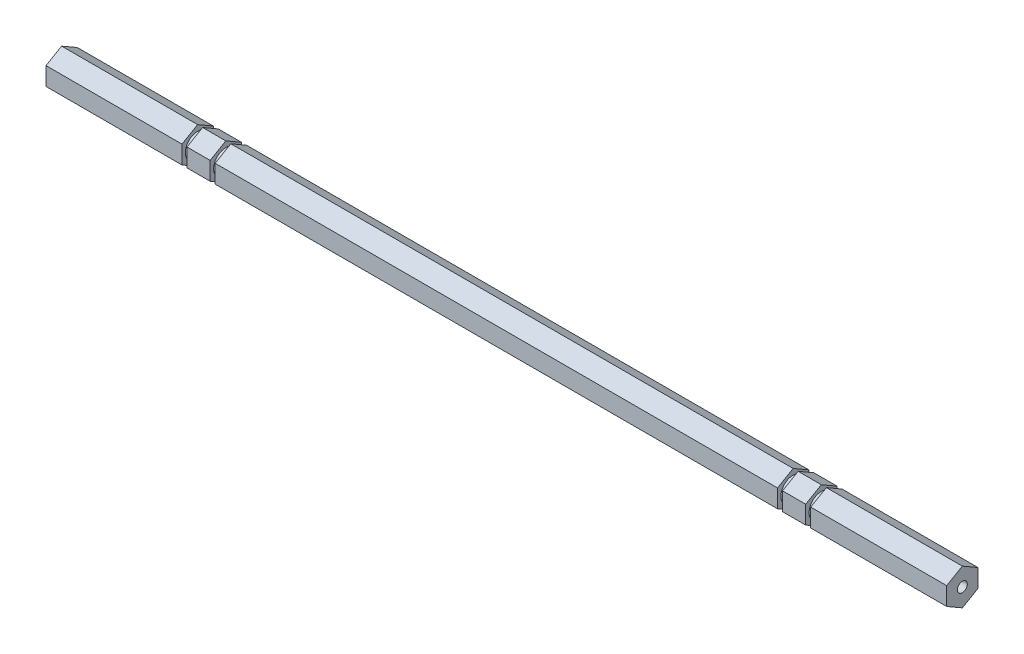
ISO-10303-21;
HEADER;
FILE_DESCRIPTION(('STEP AP214'),'2;1');
FILE_NAME('part.step','',(''),(''),'','','');
FILE_SCHEMA(('AUTOMOTIVE_DESIGN { 1 0 10303 214 1 1 1 1 }'));
ENDSEC;
DATA;
#1=APPLICATION_CONTEXT('core data for automotive mechanical design processes');
#2=APPLICATION_PROTOCOL_DEFINITION('international standard','automotive_design',2000,#1);
#3=PRODUCT_CONTEXT('',#1,'mechanical');
#4=PRODUCT('Part','Part','',(#3));
#5=PRODUCT_RELATED_PRODUCT_CATEGORY('part','',(#4));
#6=PRODUCT_DEFINITION_FORMATION('','',#4);
#7=PRODUCT_DEFINITION_CONTEXT('part definition',#1,'design');
#8=PRODUCT_DEFINITION('design','',#6,#7);
#9=PRODUCT_DEFINITION_SHAPE('','',#8);
#10=(LENGTH_UNIT() NAMED_UNIT(*) SI_UNIT(.MILLI.,.METRE.));
#11=(NAMED_UNIT(*) PLANE_ANGLE_UNIT() SI_UNIT($,.RADIAN.));
#12=(NAMED_UNIT(*) SI_UNIT($,.STERADIAN.) SOLID_ANGLE_UNIT());
#13=UNCERTAINTY_MEASURE_WITH_UNIT(LENGTH_MEASURE(1.E-05),#10,'distance_accuracy_value','');
#14=(GEOMETRIC_REPRESENTATION_CONTEXT(3) GLOBAL_UNCERTAINTY_ASSIGNED_CONTEXT((#13)) GLOBAL_UNIT_ASSIGNED_CONTEXT((#10,
#11,#12)) REPRESENTATION_CONTEXT('',''));
#15=CARTESIAN_POINT('',(0.,0.,0.));
#16=DIRECTION('',(0.,0.,1.));
#17=DIRECTION('',(1.,0.,0.));
#18=AXIS2_PLACEMENT_3D('',#15,#16,#17);
#19=CARTESIAN_POINT('',(384.52457044198,-3.66617420935407,-6.35000000000004));
#20=DIRECTION('',(0.,0.,1.));
#21=DIRECTION('',(0.,-1.,0.));
#22=AXIS2_PLACEMENT_3D('',#19,#20,#21);
#23=PLANE('',#22);
#24=DIRECTION('',(0.,1.,0.));
#25=VECTOR('',#24,1.);
#26=CARTESIAN_POINT('',(55.118,-3.66617420935407,-6.35000000000004));
#27=LINE('',#26,#25);
#28=CARTESIAN_POINT('',(55.118,-3.66617420935407,-6.35000000000004));
#29=VERTEX_POINT('',#28);
#30=CARTESIAN_POINT('',(55.118,3.6661742093542,-6.34999999999996));
#31=VERTEX_POINT('',#30);
#32=EDGE_CURVE('E79',#29,#31,#27,.T.);
#33=ORIENTED_EDGE('',*,*,#32,.F.);
#34=DIRECTION('',(-1.,0.,0.));
#35=VECTOR('',#34,1.);
#36=CARTESIAN_POINT('',(384.52457044198,-3.66617420935407,-6.35000000000004));
#37=LINE('',#36,#35);
#38=CARTESIAN_POINT('',(0.,-3.66617420935407,-6.35000000000004));
#39=VERTEX_POINT('',#38);
#40=EDGE_CURVE('E527',#29,#39,#37,.T.);
#41=ORIENTED_EDGE('',*,*,#40,.T.);
#42=DIRECTION('',(0.,1.,0.));
#43=VECTOR('',#42,1.);
#44=CARTESIAN_POINT('',(0.,-3.66617420935407,-6.35000000000004));
#45=LINE('',#44,#43);
#46=CARTESIAN_POINT('',(0.,3.6661742093542,-6.34999999999996));
#47=VERTEX_POINT('',#46);
#48=EDGE_CURVE('E518',#39,#47,#45,.T.);
#49=ORIENTED_EDGE('',*,*,#48,.T.);
#50=DIRECTION('',(-1.,0.,0.));
#51=VECTOR('',#50,1.);
#52=CARTESIAN_POINT('',(384.52457044198,3.6661742093542,-6.34999999999996));
#53=LINE('',#52,#51);
#54=EDGE_CURVE('E522',#31,#47,#53,.T.);
#55=ORIENTED_EDGE('',*,*,#54,.F.);
#56=EDGE_LOOP('',(#33,#41,#49,#55));
#57=FACE_BOUND('',#56,.T.);
#58=ADVANCED_FACE('F60',(#57),#23,.F.);
#59=CARTESIAN_POINT('',(384.52457044198,-7.33234841870825,0.));
#60=DIRECTION('',(0.,0.866025403784435,0.500000000000007));
#61=DIRECTION('',(0.,-0.500000000000007,0.866025403784435));
#62=AXIS2_PLACEMENT_3D('',#59,#60,#61);
#63=PLANE('',#62);
#64=DIRECTION('',(0.,0.500000000000007,-0.866025403784435));
#65=VECTOR('',#64,1.);
#66=CARTESIAN_POINT('',(55.118,-7.33234841870825,0.));
#67=LINE('',#66,#65);
#68=CARTESIAN_POINT('',(55.118,-7.33234841870825,0.));
#69=VERTEX_POINT('',#68);
#70=EDGE_CURVE('E449',#69,#29,#67,.T.);
#71=ORIENTED_EDGE('',*,*,#70,.F.);
#72=DIRECTION('',(-1.,0.,0.));
#73=VECTOR('',#72,1.);
#74=CARTESIAN_POINT('',(384.52457044198,-7.33234841870825,0.));
#75=LINE('',#74,#73);
#76=CARTESIAN_POINT('',(0.,-7.33234841870825,0.));
#77=VERTEX_POINT('',#76);
#78=EDGE_CURVE('E531',#69,#77,#75,.T.);
#79=ORIENTED_EDGE('',*,*,#78,.T.);
#80=DIRECTION('',(0.,0.500000000000007,-0.866025403784434));
#81=VECTOR('',#80,1.);
#82=CARTESIAN_POINT('',(0.,-7.33234841870825,0.));
#83=LINE('',#82,#81);
#84=EDGE_CURVE('E514',#77,#39,#83,.T.);
#85=ORIENTED_EDGE('',*,*,#84,.T.);
#86=ORIENTED_EDGE('',*,*,#40,.F.);
#87=EDGE_LOOP('',(#71,#79,#85,#86));
#88=FACE_BOUND('',#87,.T.);
#89=ADVANCED_FACE('F816',(#88),#63,.F.);
#90=CARTESIAN_POINT('',(384.52457044198,-3.66617420935416,6.34999999999999));
#91=DIRECTION('',(0.,0.866025403784441,-0.499999999999995));
#92=DIRECTION('',(0.,0.499999999999995,0.866025403784442));
#93=AXIS2_PLACEMENT_3D('',#90,#91,#92);
#94=PLANE('',#93);
#95=DIRECTION('',(0.,-0.499999999999995,-0.866025403784442));
#96=VECTOR('',#95,1.);
#97=CARTESIAN_POINT('',(55.118,-3.66617420935416,6.34999999999999));
#98=LINE('',#97,#96);
#99=CARTESIAN_POINT('',(55.118,-3.66617420935416,6.34999999999999));
#100=VERTEX_POINT('',#99);
#101=EDGE_CURVE('E446',#100,#69,#98,.T.);
#102=ORIENTED_EDGE('',*,*,#101,.F.);
#103=DIRECTION('',(-1.,0.,0.));
#104=VECTOR('',#103,1.);
#105=CARTESIAN_POINT('',(384.52457044198,-3.66617420935416,6.34999999999999));
#106=LINE('',#105,#104);
#107=CARTESIAN_POINT('',(0.,-3.66617420935416,6.34999999999999));
#108=VERTEX_POINT('',#107);
#109=EDGE_CURVE('E535',#100,#108,#106,.T.);
#110=ORIENTED_EDGE('',*,*,#109,.T.);
#111=DIRECTION('',(0.,-0.499999999999995,-0.866025403784442));
#112=VECTOR('',#111,1.);
#113=CARTESIAN_POINT('',(0.,-3.66617420935416,6.34999999999999));
#114=LINE('',#113,#112);
#115=EDGE_CURVE('E510',#108,#77,#114,.T.);
#116=ORIENTED_EDGE('',*,*,#115,.T.);
#117=ORIENTED_EDGE('',*,*,#78,.F.);
#118=EDGE_LOOP('',(#102,#110,#116,#117));
#119=FACE_BOUND('',#118,.T.);
#120=ADVANCED_FACE('F821',(#119),#94,.F.);
#121=CARTESIAN_POINT('',(384.52457044198,3.66617420935411,6.35000000000001));
#122=DIRECTION('',(0.,0.,-1.));
#123=DIRECTION('',(0.,1.,0.));
#124=AXIS2_PLACEMENT_3D('',#121,#122,#123);
#125=PLANE('',#124);
#126=DIRECTION('',(0.,-1.,0.));
#127=VECTOR('',#126,1.);
#128=CARTESIAN_POINT('',(55.118,3.66617420935411,6.35000000000001));
#129=LINE('',#128,#127);
#130=CARTESIAN_POINT('',(55.118,3.66617420935411,6.35000000000002));
#131=VERTEX_POINT('',#130);
#132=EDGE_CURVE('E357',#131,#100,#129,.T.);
#133=ORIENTED_EDGE('',*,*,#132,.F.);
#134=DIRECTION('',(-1.,0.,0.));
#135=VECTOR('',#134,1.);
#136=CARTESIAN_POINT('',(384.52457044198,3.66617420935411,6.35000000000001));
#137=LINE('',#136,#135);
#138=CARTESIAN_POINT('',(0.,3.66617420935411,6.35000000000001));
#139=VERTEX_POINT('',#138);
#140=EDGE_CURVE('E306',#131,#139,#137,.T.);
#141=ORIENTED_EDGE('',*,*,#140,.T.);
#142=DIRECTION('',(0.,-1.,0.));
#143=VECTOR('',#142,1.);
#144=CARTESIAN_POINT('',(0.,3.66617420935411,6.35000000000001));
#145=LINE('',#144,#143);
#146=EDGE_CURVE('E506',#139,#108,#145,.T.);
#147=ORIENTED_EDGE('',*,*,#146,.T.);
#148=ORIENTED_EDGE('',*,*,#109,.F.);
#149=EDGE_LOOP('',(#133,#141,#147,#148));
#150=FACE_BOUND('',#149,.T.);
#151=ADVANCED_FACE('F622',(#150),#125,.F.);
#152=CARTESIAN_POINT('',(384.52457044198,7.33234841870825,0.));
#153=DIRECTION('',(0.,-0.866025403784438,-0.500000000000001));
#154=DIRECTION('',(0.,0.500000000000001,-0.866025403784438));
#155=AXIS2_PLACEMENT_3D('',#152,#153,#154);
#156=PLANE('',#155);
#157=DIRECTION('',(0.,-0.500000000000001,0.866025403784438));
#158=VECTOR('',#157,1.);
#159=CARTESIAN_POINT('',(55.118,7.33234841870825,0.));
#160=LINE('',#159,#158);
#161=CARTESIAN_POINT('',(55.118,7.33234841870825,0.));
#162=VERTEX_POINT('',#161);
#163=EDGE_CURVE('E346',#162,#131,#160,.T.);
#164=ORIENTED_EDGE('',*,*,#163,.F.);
#165=DIRECTION('',(-1.,0.,0.));
#166=VECTOR('',#165,1.);
#167=CARTESIAN_POINT('',(384.52457044198,7.33234841870825,0.));
#168=LINE('',#167,#166);
#169=CARTESIAN_POINT('',(0.,7.33234841870825,0.));
#170=VERTEX_POINT('',#169);
#171=EDGE_CURVE('E305',#162,#170,#168,.T.);
#172=ORIENTED_EDGE('',*,*,#171,.T.);
#173=DIRECTION('',(0.,-0.500000000000001,0.866025403784438));
#174=VECTOR('',#173,1.);
#175=CARTESIAN_POINT('',(0.,7.33234841870825,0.));
#176=LINE('',#175,#174);
#177=EDGE_CURVE('E503',#170,#139,#176,.T.);
#178=ORIENTED_EDGE('',*,*,#177,.T.);
#179=ORIENTED_EDGE('',*,*,#140,.F.);
#180=EDGE_LOOP('',(#164,#172,#178,#179));
#181=FACE_BOUND('',#180,.T.);
#182=ADVANCED_FACE('F353',(#181),#156,.F.);
#183=CARTESIAN_POINT('',(384.52457044198,3.6661742093542,-6.34999999999996));
#184=DIRECTION('',(0.,-0.866025403784441,0.499999999999995));
#185=DIRECTION('',(0.,-0.499999999999995,-0.866025403784441));
#186=AXIS2_PLACEMENT_3D('',#183,#184,#185);
#187=PLANE('',#186);
#188=DIRECTION('',(0.,0.499999999999995,0.866025403784441));
#189=VECTOR('',#188,1.);
#190=CARTESIAN_POINT('',(55.118,3.6661742093542,-6.34999999999996));
#191=LINE('',#190,#189);
#192=EDGE_CURVE('E69',#31,#162,#191,.T.);
#193=ORIENTED_EDGE('',*,*,#192,.F.);
#194=ORIENTED_EDGE('',*,*,#54,.T.);
#195=DIRECTION('',(0.,0.499999999999995,0.866025403784441));
#196=VECTOR('',#195,1.);
#197=CARTESIAN_POINT('',(0.,3.6661742093542,-6.34999999999996));
#198=LINE('',#197,#196);
#199=EDGE_CURVE('E363',#47,#170,#198,.T.);
#200=ORIENTED_EDGE('',*,*,#199,.T.);
#201=ORIENTED_EDGE('',*,*,#171,.F.);
#202=EDGE_LOOP('',(#193,#194,#200,#201));
#203=FACE_BOUND('',#202,.T.);
#204=ADVANCED_FACE('F361',(#203),#187,.F.);
#205=CARTESIAN_POINT('',(0.,0.,0.));
#206=DIRECTION('',(1.,0.,0.));
#207=DIRECTION('',(0.,0.,-1.));
#208=AXIS2_PLACEMENT_3D('',#205,#206,#207);
#209=PLANE('',#208);
#210=CARTESIAN_POINT('',(0.,0.,0.));
#211=DIRECTION('',(-1.,0.,0.));
#212=DIRECTION('',(0.,0.,1.));
#213=AXIS2_PLACEMENT_3D('',#210,#211,#212);
#214=CIRCLE('',#213,2.01929999999999);
#215=CARTESIAN_POINT('',(0.,0.,2.01929999999999));
#216=VERTEX_POINT('',#215);
#217=EDGE_CURVE('E468',#216,#216,#214,.T.);
#218=ORIENTED_EDGE('',*,*,#217,.F.);
#219=EDGE_LOOP('',(#218));
#220=FACE_BOUND('',#219,.T.);
#221=ORIENTED_EDGE('',*,*,#199,.F.);
#222=ORIENTED_EDGE('',*,*,#48,.F.);
#223=ORIENTED_EDGE('',*,*,#84,.F.);
#224=ORIENTED_EDGE('',*,*,#115,.F.);
#225=ORIENTED_EDGE('',*,*,#146,.F.);
#226=ORIENTED_EDGE('',*,*,#177,.F.);
#227=EDGE_LOOP('',(#221,#222,#223,#224,#225,#226));
#228=FACE_BOUND('',#227,.T.);
#229=ADVANCED_FACE('F617',(#220,#228),#209,.F.);
#230=CARTESIAN_POINT('',(12.0396,0.,0.));
#231=DIRECTION('',(-1.,0.,0.));
#232=DIRECTION('',(0.,0.,1.));
#233=AXIS2_PLACEMENT_3D('',#230,#231,#232);
#234=CONICAL_SURFACE('',#233,2.01929999999999,1.02974425867665);
#235=CARTESIAN_POINT('',(13.2529178480023,0.,0.));
#236=VERTEX_POINT('',#235);
#237=VERTEX_LOOP('',#236);
#238=FACE_BOUND('',#237,.T.);
#239=CARTESIAN_POINT('',(12.0396,0.,0.));
#240=DIRECTION('',(-1.,0.,0.));
#241=DIRECTION('',(0.,0.,1.));
#242=AXIS2_PLACEMENT_3D('',#239,#240,#241);
#243=CIRCLE('',#242,2.01929999999999);
#244=CARTESIAN_POINT('',(12.0396,0.,2.01929999999999));
#245=VERTEX_POINT('',#244);
#246=EDGE_CURVE('E472',#245,#245,#243,.T.);
#247=ORIENTED_EDGE('',*,*,#246,.T.);
#248=EDGE_LOOP('',(#247));
#249=FACE_BOUND('',#248,.T.);
#250=ADVANCED_FACE('F901',(#238,#249),#234,.F.);
#251=CARTESIAN_POINT('',(0.,0.,0.));
#252=DIRECTION('',(-1.,0.,0.));
#253=DIRECTION('',(0.,0.,1.));
#254=AXIS2_PLACEMENT_3D('',#251,#252,#253);
#255=CYLINDRICAL_SURFACE('',#254,2.01929999999999);
#256=ORIENTED_EDGE('',*,*,#246,.F.);
#257=EDGE_LOOP('',(#256));
#258=FACE_BOUND('',#257,.T.);
#259=ORIENTED_EDGE('',*,*,#217,.T.);
#260=EDGE_LOOP('',(#259));
#261=FACE_BOUND('',#260,.T.);
#262=ADVANCED_FACE('F938',(#258,#261),#255,.F.);
#263=CARTESIAN_POINT('',(57.15,7.33234841870825,0.));
#264=DIRECTION('',(-1.,0.,0.));
#265=DIRECTION('',(0.,0.,1.));
#266=AXIS2_PLACEMENT_3D('',#263,#264,#265);
#267=PLANE('',#266);
#268=CARTESIAN_POINT('',(57.15,0.,0.));
#269=DIRECTION('',(-1.,0.,0.));
#270=DIRECTION('',(0.,0.,1.));
#271=AXIS2_PLACEMENT_3D('',#268,#269,#270);
#272=CIRCLE('',#271,4.9784);
#273=CARTESIAN_POINT('',(57.15,0.,4.9784));
#274=VERTEX_POINT('',#273);
#275=EDGE_CURVE('E281',#274,#274,#272,.T.);
#276=ORIENTED_EDGE('',*,*,#275,.F.);
#277=EDGE_LOOP('',(#276));
#278=FACE_BOUND('',#277,.T.);
#279=DIRECTION('',(0.,-1.,0.));
#280=VECTOR('',#279,1.);
#281=CARTESIAN_POINT('',(57.15,-3.66617420935407,-6.35000000000004));
#282=LINE('',#281,#280);
#283=CARTESIAN_POINT('',(57.15,3.6661742093542,-6.34999999999996));
#284=VERTEX_POINT('',#283);
#285=CARTESIAN_POINT('',(57.15,-3.66617420935407,-6.35000000000004));
#286=VERTEX_POINT('',#285);
#287=EDGE_CURVE('E465',#284,#286,#282,.T.);
#288=ORIENTED_EDGE('',*,*,#287,.T.);
#289=DIRECTION('',(0.,-0.500000000000007,0.866025403784435));
#290=VECTOR('',#289,1.);
#291=CARTESIAN_POINT('',(57.15,-7.33234841870825,0.));
#292=LINE('',#291,#290);
#293=CARTESIAN_POINT('',(57.15,-7.33234841870825,0.));
#294=VERTEX_POINT('',#293);
#295=EDGE_CURVE('E462',#286,#294,#292,.T.);
#296=ORIENTED_EDGE('',*,*,#295,.T.);
#297=DIRECTION('',(0.,0.499999999999995,0.866025403784442));
#298=VECTOR('',#297,1.);
#299=CARTESIAN_POINT('',(57.15,-3.66617420935416,6.34999999999999));
#300=LINE('',#299,#298);
#301=CARTESIAN_POINT('',(57.15,-3.66617420935416,6.34999999999999));
#302=VERTEX_POINT('',#301);
#303=EDGE_CURVE('E459',#294,#302,#300,.T.);
#304=ORIENTED_EDGE('',*,*,#303,.T.);
#305=DIRECTION('',(0.,1.,0.));
#306=VECTOR('',#305,1.);
#307=CARTESIAN_POINT('',(57.15,3.66617420935411,6.35000000000001));
#308=LINE('',#307,#306);
#309=CARTESIAN_POINT('',(57.15,3.66617420935411,6.35000000000002));
#310=VERTEX_POINT('',#309);
#311=EDGE_CURVE('E456',#302,#310,#308,.T.);
#312=ORIENTED_EDGE('',*,*,#311,.T.);
#313=DIRECTION('',(0.,0.500000000000001,-0.866025403784438));
#314=VECTOR('',#313,1.);
#315=CARTESIAN_POINT('',(57.15,7.33234841870825,0.));
#316=LINE('',#315,#314);
#317=CARTESIAN_POINT('',(57.15,7.33234841870825,0.));
#318=VERTEX_POINT('',#317);
#319=EDGE_CURVE('E454',#310,#318,#316,.T.);
#320=ORIENTED_EDGE('',*,*,#319,.T.);
#321=DIRECTION('',(0.,-0.499999999999995,-0.866025403784441));
#322=VECTOR('',#321,1.);
#323=CARTESIAN_POINT('',(57.15,3.6661742093542,-6.34999999999996));
#324=LINE('',#323,#322);
#325=EDGE_CURVE('E11',#318,#284,#324,.T.);
#326=ORIENTED_EDGE('',*,*,#325,.T.);
#327=EDGE_LOOP('',(#288,#296,#304,#312,#320,#326));
#328=FACE_BOUND('',#327,.T.);
#329=ADVANCED_FACE('F652',(#278,#328),#267,.T.);
#330=CARTESIAN_POINT('',(55.118,7.33234841870825,0.));
#331=DIRECTION('',(1.,0.,0.));
#332=DIRECTION('',(0.,0.,-1.));
#333=AXIS2_PLACEMENT_3D('',#330,#331,#332);
#334=PLANE('',#333);
#335=CARTESIAN_POINT('',(55.118,0.,0.));
#336=DIRECTION('',(-1.,0.,0.));
#337=DIRECTION('',(0.,0.,1.));
#338=AXIS2_PLACEMENT_3D('',#335,#336,#337);
#339=CIRCLE('',#338,4.9784);
#340=CARTESIAN_POINT('',(55.118,0.,4.9784));
#341=VERTEX_POINT('',#340);
#342=EDGE_CURVE('E716',#341,#341,#339,.T.);
#343=ORIENTED_EDGE('',*,*,#342,.T.);
#344=EDGE_LOOP('',(#343));
#345=FACE_BOUND('',#344,.T.);
#346=ORIENTED_EDGE('',*,*,#32,.T.);
#347=ORIENTED_EDGE('',*,*,#192,.T.);
#348=ORIENTED_EDGE('',*,*,#163,.T.);
#349=ORIENTED_EDGE('',*,*,#132,.T.);
#350=ORIENTED_EDGE('',*,*,#101,.T.);
#351=ORIENTED_EDGE('',*,*,#70,.T.);
#352=EDGE_LOOP('',(#346,#347,#348,#349,#350,#351));
#353=FACE_BOUND('',#352,.T.);
#354=ADVANCED_FACE('F345',(#345,#353),#334,.T.);
#355=CARTESIAN_POINT('',(0.,0.,0.));
#356=DIRECTION('',(-1.,0.,0.));
#357=DIRECTION('',(0.,0.,1.));
#358=AXIS2_PLACEMENT_3D('',#355,#356,#357);
#359=CYLINDRICAL_SURFACE('',#358,4.9784);
#360=ORIENTED_EDGE('',*,*,#275,.T.);
#361=EDGE_LOOP('',(#360));
#362=FACE_BOUND('',#361,.T.);
#363=ORIENTED_EDGE('',*,*,#342,.F.);
#364=EDGE_LOOP('',(#363));
#365=FACE_BOUND('',#364,.T.);
#366=ADVANCED_FACE('F894',(#362,#365),#359,.T.);
#367=ORIENTED_EDGE('',*,*,#325,.F.);
#368=CARTESIAN_POINT('',(66.548,7.33234841870825,0.));
#369=VERTEX_POINT('',#368);
#370=EDGE_CURVE('E365',#369,#318,#168,.T.);
#371=ORIENTED_EDGE('',*,*,#370,.F.);
#372=DIRECTION('',(0.,0.499999999999995,0.866025403784441));
#373=VECTOR('',#372,1.);
#374=CARTESIAN_POINT('',(66.5480000000001,3.6661742093542,-6.34999999999996));
#375=LINE('',#374,#373);
#376=CARTESIAN_POINT('',(66.5480000000001,3.6661742093542,-6.34999999999996));
#377=VERTEX_POINT('',#376);
#378=EDGE_CURVE('E336',#377,#369,#375,.T.);
#379=ORIENTED_EDGE('',*,*,#378,.F.);
#380=EDGE_CURVE('E601',#377,#284,#53,.T.);
#381=ORIENTED_EDGE('',*,*,#380,.T.);
#382=EDGE_LOOP('',(#367,#371,#379,#381));
#383=FACE_BOUND('',#382,.T.);
#384=ADVANCED_FACE('F62',(#383),#187,.F.);
#385=ORIENTED_EDGE('',*,*,#319,.F.);
#386=CARTESIAN_POINT('',(66.548,3.66617420935411,6.35000000000002));
#387=VERTEX_POINT('',#386);
#388=EDGE_CURVE('E309',#387,#310,#137,.T.);
#389=ORIENTED_EDGE('',*,*,#388,.F.);
#390=DIRECTION('',(0.,-0.500000000000001,0.866025403784438));
#391=VECTOR('',#390,1.);
#392=CARTESIAN_POINT('',(66.5480000000001,7.33234841870825,0.));
#393=LINE('',#392,#391);
#394=EDGE_CURVE('E408',#369,#387,#393,.T.);
#395=ORIENTED_EDGE('',*,*,#394,.F.);
#396=ORIENTED_EDGE('',*,*,#370,.T.);
#397=EDGE_LOOP('',(#385,#389,#395,#396));
#398=FACE_BOUND('',#397,.T.);
#399=ADVANCED_FACE('F653',(#398),#156,.F.);
#400=ORIENTED_EDGE('',*,*,#311,.F.);
#401=CARTESIAN_POINT('',(66.548,-3.66617420935416,6.34999999999999));
#402=VERTEX_POINT('',#401);
#403=EDGE_CURVE('E544',#402,#302,#106,.T.);
#404=ORIENTED_EDGE('',*,*,#403,.F.);
#405=DIRECTION('',(0.,-1.,0.));
#406=VECTOR('',#405,1.);
#407=CARTESIAN_POINT('',(66.5480000000001,3.66617420935411,6.35000000000001));
#408=LINE('',#407,#406);
#409=EDGE_CURVE('E414',#387,#402,#408,.T.);
#410=ORIENTED_EDGE('',*,*,#409,.F.);
#411=ORIENTED_EDGE('',*,*,#388,.T.);
#412=EDGE_LOOP('',(#400,#404,#410,#411));
#413=FACE_BOUND('',#412,.T.);
#414=ADVANCED_FACE('F649',(#413),#125,.F.);
#415=ORIENTED_EDGE('',*,*,#303,.F.);
#416=CARTESIAN_POINT('',(66.548,-7.33234841870825,0.));
#417=VERTEX_POINT('',#416);
#418=EDGE_CURVE('E548',#417,#294,#75,.T.);
#419=ORIENTED_EDGE('',*,*,#418,.F.);
#420=DIRECTION('',(0.,-0.499999999999995,-0.866025403784442));
#421=VECTOR('',#420,1.);
#422=CARTESIAN_POINT('',(66.5480000000001,-3.66617420935416,6.34999999999999));
#423=LINE('',#422,#421);
#424=EDGE_CURVE('E422',#402,#417,#423,.T.);
#425=ORIENTED_EDGE('',*,*,#424,.F.);
#426=ORIENTED_EDGE('',*,*,#403,.T.);
#427=EDGE_LOOP('',(#415,#419,#425,#426));
#428=FACE_BOUND('',#427,.T.);
#429=ADVANCED_FACE('F645',(#428),#94,.F.);
#430=ORIENTED_EDGE('',*,*,#295,.F.);
#431=CARTESIAN_POINT('',(66.548,-3.66617420935407,-6.35000000000004));
#432=VERTEX_POINT('',#431);
#433=EDGE_CURVE('E659',#432,#286,#37,.T.);
#434=ORIENTED_EDGE('',*,*,#433,.F.);
#435=DIRECTION('',(0.,0.500000000000007,-0.866025403784435));
#436=VECTOR('',#435,1.);
#437=CARTESIAN_POINT('',(66.5480000000001,-7.33234841870825,0.));
#438=LINE('',#437,#436);
#439=EDGE_CURVE('E425',#417,#432,#438,.T.);
#440=ORIENTED_EDGE('',*,*,#439,.F.);
#441=ORIENTED_EDGE('',*,*,#418,.T.);
#442=EDGE_LOOP('',(#430,#434,#440,#441));
#443=FACE_BOUND('',#442,.T.);
#444=ADVANCED_FACE('F813',(#443),#63,.F.);
#445=ORIENTED_EDGE('',*,*,#287,.F.);
#446=ORIENTED_EDGE('',*,*,#380,.F.);
#447=DIRECTION('',(0.,1.,0.));
#448=VECTOR('',#447,1.);
#449=CARTESIAN_POINT('',(66.5480000000001,-3.66617420935407,-6.35000000000004));
#450=LINE('',#449,#448);
#451=EDGE_CURVE('E87',#432,#377,#450,.T.);
#452=ORIENTED_EDGE('',*,*,#451,.F.);
#453=ORIENTED_EDGE('',*,*,#433,.T.);
#454=EDGE_LOOP('',(#445,#446,#452,#453));
#455=FACE_BOUND('',#454,.T.);
#456=ADVANCED_FACE('F657',(#455),#23,.F.);
#457=CARTESIAN_POINT('',(68.58,7.33234841870825,0.));
#458=DIRECTION('',(-1.,0.,0.));
#459=DIRECTION('',(0.,0.,1.));
#460=AXIS2_PLACEMENT_3D('',#457,#458,#459);
#461=PLANE('',#460);
#462=CARTESIAN_POINT('',(68.58,0.,0.));
#463=DIRECTION('',(-1.,0.,0.));
#464=DIRECTION('',(0.,0.,1.));
#465=AXIS2_PLACEMENT_3D('',#462,#463,#464);
#466=CIRCLE('',#465,4.9784);
#467=CARTESIAN_POINT('',(68.58,0.,4.9784));
#468=VERTEX_POINT('',#467);
#469=EDGE_CURVE('E713',#468,#468,#466,.T.);
#470=ORIENTED_EDGE('',*,*,#469,.F.);
#471=EDGE_LOOP('',(#470));
#472=FACE_BOUND('',#471,.T.);
#473=DIRECTION('',(0.,-1.,0.));
#474=VECTOR('',#473,1.);
#475=CARTESIAN_POINT('',(68.58,-3.66617420935407,-6.35000000000004));
#476=LINE('',#475,#474);
#477=CARTESIAN_POINT('',(68.58,3.6661742093542,-6.34999999999996));
#478=VERTEX_POINT('',#477);
#479=CARTESIAN_POINT('',(68.58,-3.66617420935407,-6.35000000000004));
#480=VERTEX_POINT('',#479);
#481=EDGE_CURVE('E358',#478,#480,#476,.T.);
#482=ORIENTED_EDGE('',*,*,#481,.T.);
#483=DIRECTION('',(0.,-0.500000000000007,0.866025403784435));
#484=VECTOR('',#483,1.);
#485=CARTESIAN_POINT('',(68.58,-7.33234841870825,0.));
#486=LINE('',#485,#484);
#487=CARTESIAN_POINT('',(68.58,-7.33234841870825,0.));
#488=VERTEX_POINT('',#487);
#489=EDGE_CURVE('E439',#480,#488,#486,.T.);
#490=ORIENTED_EDGE('',*,*,#489,.T.);
#491=DIRECTION('',(0.,0.499999999999995,0.866025403784442));
#492=VECTOR('',#491,1.);
#493=CARTESIAN_POINT('',(68.58,-3.66617420935416,6.34999999999999));
#494=LINE('',#493,#492);
#495=CARTESIAN_POINT('',(68.58,-3.66617420935416,6.34999999999999));
#496=VERTEX_POINT('',#495);
#497=EDGE_CURVE('E436',#488,#496,#494,.T.);
#498=ORIENTED_EDGE('',*,*,#497,.T.);
#499=DIRECTION('',(0.,1.,0.));
#500=VECTOR('',#499,1.);
#501=CARTESIAN_POINT('',(68.58,3.66617420935411,6.35000000000001));
#502=LINE('',#501,#500);
#503=CARTESIAN_POINT('',(68.58,3.66617420935411,6.35000000000002));
#504=VERTEX_POINT('',#503);
#505=EDGE_CURVE('E433',#496,#504,#502,.T.);
#506=ORIENTED_EDGE('',*,*,#505,.T.);
#507=DIRECTION('',(0.,0.500000000000001,-0.866025403784438));
#508=VECTOR('',#507,1.);
#509=CARTESIAN_POINT('',(68.58,7.33234841870825,0.));
#510=LINE('',#509,#508);
#511=CARTESIAN_POINT('',(68.58,7.33234841870825,0.));
#512=VERTEX_POINT('',#511);
#513=EDGE_CURVE('E430',#504,#512,#510,.T.);
#514=ORIENTED_EDGE('',*,*,#513,.T.);
#515=DIRECTION('',(0.,-0.499999999999995,-0.866025403784441));
#516=VECTOR('',#515,1.);
#517=CARTESIAN_POINT('',(68.58,3.6661742093542,-6.34999999999996));
#518=LINE('',#517,#516);
#519=EDGE_CURVE('E339',#512,#478,#518,.T.);
#520=ORIENTED_EDGE('',*,*,#519,.T.);
#521=EDGE_LOOP('',(#482,#490,#498,#506,#514,#520));
#522=FACE_BOUND('',#521,.T.);
#523=ADVANCED_FACE('F583',(#472,#522),#461,.T.);
#524=CARTESIAN_POINT('',(66.548,7.33234841870825,0.));
#525=DIRECTION('',(1.,0.,0.));
#526=DIRECTION('',(0.,0.,-1.));
#527=AXIS2_PLACEMENT_3D('',#524,#525,#526);
#528=PLANE('',#527);
#529=CARTESIAN_POINT('',(66.548,0.,0.));
#530=DIRECTION('',(-1.,0.,0.));
#531=DIRECTION('',(0.,0.,1.));
#532=AXIS2_PLACEMENT_3D('',#529,#530,#531);
#533=CIRCLE('',#532,4.9784);
#534=CARTESIAN_POINT('',(66.548,0.,4.9784));
#535=VERTEX_POINT('',#534);
#536=EDGE_CURVE('E717',#535,#535,#533,.T.);
#537=ORIENTED_EDGE('',*,*,#536,.T.);
#538=EDGE_LOOP('',(#537));
#539=FACE_BOUND('',#538,.T.);
#540=ORIENTED_EDGE('',*,*,#451,.T.);
#541=ORIENTED_EDGE('',*,*,#378,.T.);
#542=ORIENTED_EDGE('',*,*,#394,.T.);
#543=ORIENTED_EDGE('',*,*,#409,.T.);
#544=ORIENTED_EDGE('',*,*,#424,.T.);
#545=ORIENTED_EDGE('',*,*,#439,.T.);
#546=EDGE_LOOP('',(#540,#541,#542,#543,#544,#545));
#547=FACE_BOUND('',#546,.T.);
#548=ADVANCED_FACE('F829',(#539,#547),#528,.T.);
#549=CARTESIAN_POINT('',(0.,0.,0.));
#550=DIRECTION('',(-1.,0.,0.));
#551=DIRECTION('',(0.,0.,1.));
#552=AXIS2_PLACEMENT_3D('',#549,#550,#551);
#553=CYLINDRICAL_SURFACE('',#552,4.9784);
#554=ORIENTED_EDGE('',*,*,#469,.T.);
#555=EDGE_LOOP('',(#554));
#556=FACE_BOUND('',#555,.T.);
#557=ORIENTED_EDGE('',*,*,#536,.F.);
#558=EDGE_LOOP('',(#557));
#559=FACE_BOUND('',#558,.T.);
#560=ADVANCED_FACE('F904',(#556,#559),#553,.T.);
#561=ORIENTED_EDGE('',*,*,#519,.F.);
#562=CARTESIAN_POINT('',(296.545,7.33234841870825,0.));
#563=VERTEX_POINT('',#562);
#564=EDGE_CURVE('E371',#563,#512,#168,.T.);
#565=ORIENTED_EDGE('',*,*,#564,.F.);
#566=DIRECTION('',(0.,0.499999999999995,0.866025403784441));
#567=VECTOR('',#566,1.);
#568=CARTESIAN_POINT('',(296.545,3.6661742093542,-6.34999999999996));
#569=LINE('',#568,#567);
#570=CARTESIAN_POINT('',(296.545,3.6661742093542,-6.34999999999996));
#571=VERTEX_POINT('',#570);
#572=EDGE_CURVE('E330',#571,#563,#569,.T.);
#573=ORIENTED_EDGE('',*,*,#572,.F.);
#574=EDGE_CURVE('E598',#571,#478,#53,.T.);
#575=ORIENTED_EDGE('',*,*,#574,.T.);
#576=EDGE_LOOP('',(#561,#565,#573,#575));
#577=FACE_BOUND('',#576,.T.);
#578=ADVANCED_FACE('F595',(#577),#187,.F.);
#579=ORIENTED_EDGE('',*,*,#513,.F.);
#580=CARTESIAN_POINT('',(296.545,3.66617420935411,6.35000000000001));
#581=VERTEX_POINT('',#580);
#582=EDGE_CURVE('E299',#581,#504,#137,.T.);
#583=ORIENTED_EDGE('',*,*,#582,.F.);
#584=DIRECTION('',(0.,-0.500000000000001,0.866025403784438));
#585=VECTOR('',#584,1.);
#586=CARTESIAN_POINT('',(296.545,7.33234841870825,0.));
#587=LINE('',#586,#585);
#588=EDGE_CURVE('E590',#563,#581,#587,.T.);
#589=ORIENTED_EDGE('',*,*,#588,.F.);
#590=ORIENTED_EDGE('',*,*,#564,.T.);
#591=EDGE_LOOP('',(#579,#583,#589,#590));
#592=FACE_BOUND('',#591,.T.);
#593=ADVANCED_FACE('F589',(#592),#156,.F.);
#594=ORIENTED_EDGE('',*,*,#505,.F.);
#595=CARTESIAN_POINT('',(296.545,-3.66617420935416,6.34999999999999));
#596=VERTEX_POINT('',#595);
#597=EDGE_CURVE('E580',#596,#496,#106,.T.);
#598=ORIENTED_EDGE('',*,*,#597,.F.);
#599=DIRECTION('',(0.,-1.,0.));
#600=VECTOR('',#599,1.);
#601=CARTESIAN_POINT('',(296.545,3.66617420935411,6.35000000000001));
#602=LINE('',#601,#600);
#603=EDGE_CURVE('E588',#581,#596,#602,.T.);
#604=ORIENTED_EDGE('',*,*,#603,.F.);
#605=ORIENTED_EDGE('',*,*,#582,.T.);
#606=EDGE_LOOP('',(#594,#598,#604,#605));
#607=FACE_BOUND('',#606,.T.);
#608=ADVANCED_FACE('F585',(#607),#125,.F.);
#609=ORIENTED_EDGE('',*,*,#497,.F.);
#610=CARTESIAN_POINT('',(296.545,-7.33234841870825,0.));
#611=VERTEX_POINT('',#610);
#612=EDGE_CURVE('E546',#611,#488,#75,.T.);
#613=ORIENTED_EDGE('',*,*,#612,.F.);
#614=DIRECTION('',(0.,-0.499999999999995,-0.866025403784442));
#615=VECTOR('',#614,1.);
#616=CARTESIAN_POINT('',(296.545,-3.66617420935416,6.34999999999999));
#617=LINE('',#616,#615);
#618=EDGE_CURVE('E578',#596,#611,#617,.T.);
#619=ORIENTED_EDGE('',*,*,#618,.F.);
#620=ORIENTED_EDGE('',*,*,#597,.T.);
#621=EDGE_LOOP('',(#609,#613,#619,#620));
#622=FACE_BOUND('',#621,.T.);
#623=ADVANCED_FACE('F576',(#622),#94,.F.);
#624=ORIENTED_EDGE('',*,*,#489,.F.);
#625=CARTESIAN_POINT('',(296.545,-3.66617420935407,-6.35000000000004));
#626=VERTEX_POINT('',#625);
#627=EDGE_CURVE('E661',#626,#480,#37,.T.);
#628=ORIENTED_EDGE('',*,*,#627,.F.);
#629=DIRECTION('',(0.,0.500000000000007,-0.866025403784435));
#630=VECTOR('',#629,1.);
#631=CARTESIAN_POINT('',(296.545,-7.33234841870825,0.));
#632=LINE('',#631,#630);
#633=EDGE_CURVE('E572',#611,#626,#632,.T.);
#634=ORIENTED_EDGE('',*,*,#633,.F.);
#635=ORIENTED_EDGE('',*,*,#612,.T.);
#636=EDGE_LOOP('',(#624,#628,#634,#635));
#637=FACE_BOUND('',#636,.T.);
#638=ADVANCED_FACE('F569',(#637),#63,.F.);
#639=ORIENTED_EDGE('',*,*,#481,.F.);
#640=ORIENTED_EDGE('',*,*,#574,.F.);
#641=DIRECTION('',(0.,1.,0.));
#642=VECTOR('',#641,1.);
#643=CARTESIAN_POINT('',(296.545,-3.66617420935407,-6.35000000000004));
#644=LINE('',#643,#642);
#645=EDGE_CURVE('E781',#626,#571,#644,.T.);
#646=ORIENTED_EDGE('',*,*,#645,.F.);
#647=ORIENTED_EDGE('',*,*,#627,.T.);
#648=EDGE_LOOP('',(#639,#640,#646,#647));
#649=FACE_BOUND('',#648,.T.);
#650=ADVANCED_FACE('F810',(#649),#23,.F.);
#651=CARTESIAN_POINT('',(298.577,7.33234841870825,0.));
#652=DIRECTION('',(-1.,0.,0.));
#653=DIRECTION('',(0.,0.,1.));
#654=AXIS2_PLACEMENT_3D('',#651,#652,#653);
#655=PLANE('',#654);
#656=CARTESIAN_POINT('',(298.577,0.,0.));
#657=DIRECTION('',(-1.,0.,0.));
#658=DIRECTION('',(0.,0.,1.));
#659=AXIS2_PLACEMENT_3D('',#656,#657,#658);
#660=CIRCLE('',#659,4.9784);
#661=CARTESIAN_POINT('',(298.577,0.,4.9784));
#662=VERTEX_POINT('',#661);
#663=EDGE_CURVE('E727',#662,#662,#660,.T.);
#664=ORIENTED_EDGE('',*,*,#663,.F.);
#665=EDGE_LOOP('',(#664));
#666=FACE_BOUND('',#665,.T.);
#667=DIRECTION('',(0.,-1.,0.));
#668=VECTOR('',#667,1.);
#669=CARTESIAN_POINT('',(298.577,-3.66617420935407,-6.35000000000004));
#670=LINE('',#669,#668);
#671=CARTESIAN_POINT('',(298.577,3.6661742093542,-6.34999999999997));
#672=VERTEX_POINT('',#671);
#673=CARTESIAN_POINT('',(298.577,-3.66617420935407,-6.35000000000004));
#674=VERTEX_POINT('',#673);
#675=EDGE_CURVE('E399',#672,#674,#670,.T.);
#676=ORIENTED_EDGE('',*,*,#675,.T.);
#677=DIRECTION('',(0.,-0.500000000000007,0.866025403784435));
#678=VECTOR('',#677,1.);
#679=CARTESIAN_POINT('',(298.577,-7.33234841870825,0.));
#680=LINE('',#679,#678);
#681=CARTESIAN_POINT('',(298.577,-7.33234841870825,0.));
#682=VERTEX_POINT('',#681);
#683=EDGE_CURVE('E409',#674,#682,#680,.T.);
#684=ORIENTED_EDGE('',*,*,#683,.T.);
#685=DIRECTION('',(0.,0.499999999999995,0.866025403784442));
#686=VECTOR('',#685,1.);
#687=CARTESIAN_POINT('',(298.577,-3.66617420935416,6.34999999999999));
#688=LINE('',#687,#686);
#689=CARTESIAN_POINT('',(298.577,-3.66617420935416,6.34999999999999));
#690=VERTEX_POINT('',#689);
#691=EDGE_CURVE('E416',#682,#690,#688,.T.);
#692=ORIENTED_EDGE('',*,*,#691,.T.);
#693=DIRECTION('',(0.,1.,0.));
#694=VECTOR('',#693,1.);
#695=CARTESIAN_POINT('',(298.577,3.66617420935411,6.35000000000001));
#696=LINE('',#695,#694);
#697=CARTESIAN_POINT('',(298.577,3.66617420935411,6.35000000000002));
#698=VERTEX_POINT('',#697);
#699=EDGE_CURVE('E786',#690,#698,#696,.T.);
#700=ORIENTED_EDGE('',*,*,#699,.T.);
#701=DIRECTION('',(0.,0.500000000000001,-0.866025403784438));
#702=VECTOR('',#701,1.);
#703=CARTESIAN_POINT('',(298.577,7.33234841870825,0.));
#704=LINE('',#703,#702);
#705=CARTESIAN_POINT('',(298.577,7.33234841870825,0.));
#706=VERTEX_POINT('',#705);
#707=EDGE_CURVE('E296',#698,#706,#704,.T.);
#708=ORIENTED_EDGE('',*,*,#707,.T.);
#709=DIRECTION('',(0.,-0.499999999999995,-0.866025403784441));
#710=VECTOR('',#709,1.);
#711=CARTESIAN_POINT('',(298.577,3.6661742093542,-6.34999999999996));
#712=LINE('',#711,#710);
#713=EDGE_CURVE('E333',#706,#672,#712,.T.);
#714=ORIENTED_EDGE('',*,*,#713,.T.);
#715=EDGE_LOOP('',(#676,#684,#692,#700,#708,#714));
#716=FACE_BOUND('',#715,.T.);
#717=ADVANCED_FACE('F398',(#666,#716),#655,.T.);
#718=CARTESIAN_POINT('',(296.545,7.33234841870825,0.));
#719=DIRECTION('',(1.,0.,0.));
#720=DIRECTION('',(0.,0.,-1.));
#721=AXIS2_PLACEMENT_3D('',#718,#719,#720);
#722=PLANE('',#721);
#723=CARTESIAN_POINT('',(296.545,0.,0.));
#724=DIRECTION('',(-1.,0.,0.));
#725=DIRECTION('',(0.,0.,1.));
#726=AXIS2_PLACEMENT_3D('',#723,#724,#725);
#727=CIRCLE('',#726,4.9784);
#728=CARTESIAN_POINT('',(296.545,0.,4.9784));
#729=VERTEX_POINT('',#728);
#730=EDGE_CURVE('E732',#729,#729,#727,.T.);
#731=ORIENTED_EDGE('',*,*,#730,.T.);
#732=EDGE_LOOP('',(#731));
#733=FACE_BOUND('',#732,.T.);
#734=ORIENTED_EDGE('',*,*,#645,.T.);
#735=ORIENTED_EDGE('',*,*,#572,.T.);
#736=ORIENTED_EDGE('',*,*,#588,.T.);
#737=ORIENTED_EDGE('',*,*,#603,.T.);
#738=ORIENTED_EDGE('',*,*,#618,.T.);
#739=ORIENTED_EDGE('',*,*,#633,.T.);
#740=EDGE_LOOP('',(#734,#735,#736,#737,#738,#739));
#741=FACE_BOUND('',#740,.T.);
#742=ADVANCED_FACE('F918',(#733,#741),#722,.T.);
#743=CARTESIAN_POINT('',(0.,0.,0.));
#744=DIRECTION('',(-1.,0.,0.));
#745=DIRECTION('',(0.,0.,1.));
#746=AXIS2_PLACEMENT_3D('',#743,#744,#745);
#747=CYLINDRICAL_SURFACE('',#746,4.9784);
#748=ORIENTED_EDGE('',*,*,#663,.T.);
#749=EDGE_LOOP('',(#748));
#750=FACE_BOUND('',#749,.T.);
#751=ORIENTED_EDGE('',*,*,#730,.F.);
#752=EDGE_LOOP('',(#751));
#753=FACE_BOUND('',#752,.T.);
#754=ADVANCED_FACE('F883',(#750,#753),#747,.T.);
#755=ORIENTED_EDGE('',*,*,#713,.F.);
#756=CARTESIAN_POINT('',(307.975,7.33234841870825,0.));
#757=VERTEX_POINT('',#756);
#758=EDGE_CURVE('E319',#757,#706,#168,.T.);
#759=ORIENTED_EDGE('',*,*,#758,.F.);
#760=DIRECTION('',(0.,0.499999999999995,0.866025403784441));
#761=VECTOR('',#760,1.);
#762=CARTESIAN_POINT('',(307.975,3.6661742093542,-6.34999999999996));
#763=LINE('',#762,#761);
#764=CARTESIAN_POINT('',(307.975,3.6661742093542,-6.34999999999996));
#765=VERTEX_POINT('',#764);
#766=EDGE_CURVE('E275',#765,#757,#763,.T.);
#767=ORIENTED_EDGE('',*,*,#766,.F.);
#768=EDGE_CURVE('E395',#765,#672,#53,.T.);
#769=ORIENTED_EDGE('',*,*,#768,.T.);
#770=EDGE_LOOP('',(#755,#759,#767,#769));
#771=FACE_BOUND('',#770,.T.);
#772=ADVANCED_FACE('F392',(#771),#187,.F.);
#773=ORIENTED_EDGE('',*,*,#707,.F.);
#774=CARTESIAN_POINT('',(307.975,3.66617420935411,6.35000000000001));
#775=VERTEX_POINT('',#774);
#776=EDGE_CURVE('E288',#775,#698,#137,.T.);
#777=ORIENTED_EDGE('',*,*,#776,.F.);
#778=DIRECTION('',(0.,-0.500000000000001,0.866025403784438));
#779=VECTOR('',#778,1.);
#780=CARTESIAN_POINT('',(307.975,7.33234841870825,0.));
#781=LINE('',#780,#779);
#782=EDGE_CURVE('E269',#757,#775,#781,.T.);
#783=ORIENTED_EDGE('',*,*,#782,.F.);
#784=ORIENTED_EDGE('',*,*,#758,.T.);
#785=EDGE_LOOP('',(#773,#777,#783,#784));
#786=FACE_BOUND('',#785,.T.);
#787=ADVANCED_FACE('F295',(#786),#156,.F.);
#788=ORIENTED_EDGE('',*,*,#699,.F.);
#789=CARTESIAN_POINT('',(307.975,-3.66617420935416,6.34999999999999));
#790=VERTEX_POINT('',#789);
#791=EDGE_CURVE('E290',#790,#690,#106,.T.);
#792=ORIENTED_EDGE('',*,*,#791,.F.);
#793=DIRECTION('',(0.,-1.,0.));
#794=VECTOR('',#793,1.);
#795=CARTESIAN_POINT('',(307.975,3.66617420935411,6.35000000000001));
#796=LINE('',#795,#794);
#797=EDGE_CURVE('E272',#775,#790,#796,.T.);
#798=ORIENTED_EDGE('',*,*,#797,.F.);
#799=ORIENTED_EDGE('',*,*,#776,.T.);
#800=EDGE_LOOP('',(#788,#792,#798,#799));
#801=FACE_BOUND('',#800,.T.);
#802=ADVANCED_FACE('F287',(#801),#125,.F.);
#803=ORIENTED_EDGE('',*,*,#691,.F.);
#804=CARTESIAN_POINT('',(307.975,-7.33234841870825,0.));
#805=VERTEX_POINT('',#804);
#806=EDGE_CURVE('E536',#805,#682,#75,.T.);
#807=ORIENTED_EDGE('',*,*,#806,.F.);
#808=DIRECTION('',(0.,-0.499999999999995,-0.866025403784442));
#809=VECTOR('',#808,1.);
#810=CARTESIAN_POINT('',(307.975,-3.66617420935416,6.34999999999999));
#811=LINE('',#810,#809);
#812=EDGE_CURVE('E292',#790,#805,#811,.T.);
#813=ORIENTED_EDGE('',*,*,#812,.F.);
#814=ORIENTED_EDGE('',*,*,#791,.T.);
#815=EDGE_LOOP('',(#803,#807,#813,#814));
#816=FACE_BOUND('',#815,.T.);
#817=ADVANCED_FACE('F791',(#816),#94,.F.);
#818=ORIENTED_EDGE('',*,*,#683,.F.);
#819=CARTESIAN_POINT('',(307.975,-3.66617420935407,-6.35000000000004));
#820=VERTEX_POINT('',#819);
#821=EDGE_CURVE('E406',#820,#674,#37,.T.);
#822=ORIENTED_EDGE('',*,*,#821,.F.);
#823=DIRECTION('',(0.,0.500000000000007,-0.866025403784435));
#824=VECTOR('',#823,1.);
#825=CARTESIAN_POINT('',(307.975,-7.33234841870825,0.));
#826=LINE('',#825,#824);
#827=EDGE_CURVE('E752',#805,#820,#826,.T.);
#828=ORIENTED_EDGE('',*,*,#827,.F.);
#829=ORIENTED_EDGE('',*,*,#806,.T.);
#830=EDGE_LOOP('',(#818,#822,#828,#829));
#831=FACE_BOUND('',#830,.T.);
#832=ADVANCED_FACE('F794',(#831),#63,.F.);
#833=ORIENTED_EDGE('',*,*,#675,.F.);
#834=ORIENTED_EDGE('',*,*,#768,.F.);
#835=DIRECTION('',(0.,1.,0.));
#836=VECTOR('',#835,1.);
#837=CARTESIAN_POINT('',(307.975,-3.66617420935407,-6.35000000000004));
#838=LINE('',#837,#836);
#839=EDGE_CURVE('E755',#820,#765,#838,.T.);
#840=ORIENTED_EDGE('',*,*,#839,.F.);
#841=ORIENTED_EDGE('',*,*,#821,.T.);
#842=EDGE_LOOP('',(#833,#834,#840,#841));
#843=FACE_BOUND('',#842,.T.);
#844=ADVANCED_FACE('F403',(#843),#23,.F.);
#845=CARTESIAN_POINT('',(310.007,7.33234841870825,0.));
#846=DIRECTION('',(-1.,0.,0.));
#847=DIRECTION('',(0.,0.,1.));
#848=AXIS2_PLACEMENT_3D('',#845,#846,#847);
#849=PLANE('',#848);
#850=CARTESIAN_POINT('',(310.007,0.,0.));
#851=DIRECTION('',(-1.,0.,0.));
#852=DIRECTION('',(0.,0.,1.));
#853=AXIS2_PLACEMENT_3D('',#850,#851,#852);
#854=CIRCLE('',#853,4.9784);
#855=CARTESIAN_POINT('',(310.007,0.,4.9784));
#856=VERTEX_POINT('',#855);
#857=EDGE_CURVE('E737',#856,#856,#854,.T.);
#858=ORIENTED_EDGE('',*,*,#857,.F.);
#859=EDGE_LOOP('',(#858));
#860=FACE_BOUND('',#859,.T.);
#861=DIRECTION('',(0.,-1.,0.));
#862=VECTOR('',#861,1.);
#863=CARTESIAN_POINT('',(310.007,-3.66617420935407,-6.35000000000004));
#864=LINE('',#863,#862);
#865=CARTESIAN_POINT('',(310.007,3.6661742093542,-6.34999999999996));
#866=VERTEX_POINT('',#865);
#867=CARTESIAN_POINT('',(310.007,-3.66617420935407,-6.35000000000004));
#868=VERTEX_POINT('',#867);
#869=EDGE_CURVE('E770',#866,#868,#864,.T.);
#870=ORIENTED_EDGE('',*,*,#869,.T.);
#871=DIRECTION('',(0.,-0.500000000000007,0.866025403784435));
#872=VECTOR('',#871,1.);
#873=CARTESIAN_POINT('',(310.007,-7.33234841870825,0.));
#874=LINE('',#873,#872);
#875=CARTESIAN_POINT('',(310.007,-7.33234841870825,0.));
#876=VERTEX_POINT('',#875);
#877=EDGE_CURVE('E767',#868,#876,#874,.T.);
#878=ORIENTED_EDGE('',*,*,#877,.T.);
#879=DIRECTION('',(0.,0.499999999999995,0.866025403784442));
#880=VECTOR('',#879,1.);
#881=CARTESIAN_POINT('',(310.007,-3.66617420935416,6.34999999999999));
#882=LINE('',#881,#880);
#883=CARTESIAN_POINT('',(310.007,-3.66617420935416,6.34999999999999));
#884=VERTEX_POINT('',#883);
#885=EDGE_CURVE('E764',#876,#884,#882,.T.);
#886=ORIENTED_EDGE('',*,*,#885,.T.);
#887=DIRECTION('',(0.,1.,0.));
#888=VECTOR('',#887,1.);
#889=CARTESIAN_POINT('',(310.007,3.66617420935411,6.35000000000001));
#890=LINE('',#889,#888);
#891=CARTESIAN_POINT('',(310.007,3.66617420935411,6.35000000000001));
#892=VERTEX_POINT('',#891);
#893=EDGE_CURVE('E761',#884,#892,#890,.T.);
#894=ORIENTED_EDGE('',*,*,#893,.T.);
#895=DIRECTION('',(0.,0.500000000000001,-0.866025403784438));
#896=VECTOR('',#895,1.);
#897=CARTESIAN_POINT('',(310.007,7.33234841870825,0.));
#898=LINE('',#897,#896);
#899=CARTESIAN_POINT('',(310.007,7.33234841870825,0.));
#900=VERTEX_POINT('',#899);
#901=EDGE_CURVE('E758',#892,#900,#898,.T.);
#902=ORIENTED_EDGE('',*,*,#901,.T.);
#903=DIRECTION('',(0.,-0.499999999999995,-0.866025403784441));
#904=VECTOR('',#903,1.);
#905=CARTESIAN_POINT('',(310.007,3.6661742093542,-6.34999999999996));
#906=LINE('',#905,#904);
#907=EDGE_CURVE('E326',#900,#866,#906,.T.);
#908=ORIENTED_EDGE('',*,*,#907,.T.);
#909=EDGE_LOOP('',(#870,#878,#886,#894,#902,#908));
#910=FACE_BOUND('',#909,.T.);
#911=ADVANCED_FACE('F807',(#860,#910),#849,.T.);
#912=CARTESIAN_POINT('',(307.975,7.33234841870825,0.));
#913=DIRECTION('',(1.,0.,0.));
#914=DIRECTION('',(0.,0.,-1.));
#915=AXIS2_PLACEMENT_3D('',#912,#913,#914);
#916=PLANE('',#915);
#917=CARTESIAN_POINT('',(307.975,0.,0.));
#918=DIRECTION('',(-1.,0.,0.));
#919=DIRECTION('',(0.,0.,1.));
#920=AXIS2_PLACEMENT_3D('',#917,#918,#919);
#921=CIRCLE('',#920,4.9784);
#922=CARTESIAN_POINT('',(307.975,0.,4.9784));
#923=VERTEX_POINT('',#922);
#924=EDGE_CURVE('E742',#923,#923,#921,.T.);
#925=ORIENTED_EDGE('',*,*,#924,.T.);
#926=EDGE_LOOP('',(#925));
#927=FACE_BOUND('',#926,.T.);
#928=ORIENTED_EDGE('',*,*,#839,.T.);
#929=ORIENTED_EDGE('',*,*,#766,.T.);
#930=ORIENTED_EDGE('',*,*,#782,.T.);
#931=ORIENTED_EDGE('',*,*,#797,.T.);
#932=ORIENTED_EDGE('',*,*,#812,.T.);
#933=ORIENTED_EDGE('',*,*,#827,.T.);
#934=EDGE_LOOP('',(#928,#929,#930,#931,#932,#933));
#935=FACE_BOUND('',#934,.T.);
#936=ADVANCED_FACE('F271',(#927,#935),#916,.T.);
#937=CARTESIAN_POINT('',(0.,0.,0.));
#938=DIRECTION('',(-1.,0.,0.));
#939=DIRECTION('',(0.,0.,1.));
#940=AXIS2_PLACEMENT_3D('',#937,#938,#939);
#941=CYLINDRICAL_SURFACE('',#940,4.9784);
#942=ORIENTED_EDGE('',*,*,#857,.T.);
#943=EDGE_LOOP('',(#942));
#944=FACE_BOUND('',#943,.T.);
#945=ORIENTED_EDGE('',*,*,#924,.F.);
#946=EDGE_LOOP('',(#945));
#947=FACE_BOUND('',#946,.T.);
#948=ADVANCED_FACE('F930',(#944,#947),#941,.T.);
#949=CARTESIAN_POINT('',(353.0854,-9.81495891894259E-12,-5.98148006308145E-12));
#950=DIRECTION('',(1.,0.,0.));
#951=DIRECTION('',(0.,0.,-1.));
#952=AXIS2_PLACEMENT_3D('',#949,#950,#951);
#953=CONICAL_SURFACE('',#952,2.01929999999999,1.02974425867664);
#954=CARTESIAN_POINT('',(351.872082151998,-9.81820494762698E-12,-5.98148006308145E-12));
#955=VERTEX_POINT('',#954);
#956=VERTEX_LOOP('',#955);
#957=FACE_BOUND('',#956,.T.);
#958=CARTESIAN_POINT('',(353.0854,-9.81495891894259E-12,-5.98148006308145E-12));
#959=DIRECTION('',(1.,0.,0.));
#960=DIRECTION('',(0.,0.,-1.));
#961=AXIS2_PLACEMENT_3D('',#958,#959,#960);
#962=CIRCLE('',#961,2.01929999999999);
#963=CARTESIAN_POINT('',(353.0854,-9.81495891894259E-12,-2.01930000000597));
#964=VERTEX_POINT('',#963);
#965=EDGE_CURVE('E479',#964,#964,#962,.T.);
#966=ORIENTED_EDGE('',*,*,#965,.T.);
#967=EDGE_LOOP('',(#966));
#968=FACE_BOUND('',#967,.T.);
#969=ADVANCED_FACE('F933',(#957,#968),#953,.F.);
#970=CARTESIAN_POINT('',(365.125,-9.81495891894259E-12,-5.98148006308145E-12));
#971=DIRECTION('',(1.,0.,0.));
#972=DIRECTION('',(0.,0.,-1.));
#973=AXIS2_PLACEMENT_3D('',#970,#971,#972);
#974=CYLINDRICAL_SURFACE('',#973,2.01929999999999);
#975=ORIENTED_EDGE('',*,*,#965,.F.);
#976=EDGE_LOOP('',(#975));
#977=FACE_BOUND('',#976,.T.);
#978=CARTESIAN_POINT('',(365.125,-9.81495891894259E-12,-5.98148006308145E-12));
#979=DIRECTION('',(1.,0.,0.));
#980=DIRECTION('',(0.,0.,-1.));
#981=AXIS2_PLACEMENT_3D('',#978,#979,#980);
#982=CIRCLE('',#981,2.01929999999999);
#983=CARTESIAN_POINT('',(365.125,-9.81495891894259E-12,-2.01930000000597));
#984=VERTEX_POINT('',#983);
#985=EDGE_CURVE('E475',#984,#984,#982,.T.);
#986=ORIENTED_EDGE('',*,*,#985,.T.);
#987=EDGE_LOOP('',(#986));
#988=FACE_BOUND('',#987,.T.);
#989=ADVANCED_FACE('F945',(#977,#988),#974,.F.);
#990=CARTESIAN_POINT('',(365.125,0.332393751131601,0.201658853649832));
#991=DIRECTION('',(-1.,0.,0.));
#992=DIRECTION('',(0.,0.518693123093516,-0.85496049268694));
#993=AXIS2_PLACEMENT_3D('',#990,#991,#992);
#994=PLANE('',#993);
#995=DIRECTION('',(0.,0.500000000000001,-0.866025403784438));
#996=VECTOR('',#995,1.);
#997=CARTESIAN_POINT('',(365.125,7.33234841870825,0.));
#998=LINE('',#997,#996);
#999=CARTESIAN_POINT('',(365.125,3.66617420935411,6.35000000000001));
#1000=VERTEX_POINT('',#999);
#1001=CARTESIAN_POINT('',(365.125,7.33234841870825,0.));
#1002=VERTEX_POINT('',#1001);
#1003=EDGE_CURVE('E494',#1000,#1002,#998,.T.);
#1004=ORIENTED_EDGE('',*,*,#1003,.F.);
#1005=DIRECTION('',(0.,1.,0.));
#1006=VECTOR('',#1005,1.);
#1007=CARTESIAN_POINT('',(365.125,3.66617420935463,6.35000000000001));
#1008=LINE('',#1007,#1006);
#1009=CARTESIAN_POINT('',(365.125,-3.66617420935416,6.34999999999999));
#1010=VERTEX_POINT('',#1009);
#1011=EDGE_CURVE('E490',#1010,#1000,#1008,.T.);
#1012=ORIENTED_EDGE('',*,*,#1011,.F.);
#1013=DIRECTION('',(0.,0.499999999999995,0.866025403784442));
#1014=VECTOR('',#1013,1.);
#1015=CARTESIAN_POINT('',(365.125,-3.66617420935389,6.35000000000045));
#1016=LINE('',#1015,#1014);
#1017=CARTESIAN_POINT('',(365.125,-7.33234841870825,0.));
#1018=VERTEX_POINT('',#1017);
#1019=EDGE_CURVE('E486',#1018,#1010,#1016,.T.);
#1020=ORIENTED_EDGE('',*,*,#1019,.F.);
#1021=DIRECTION('',(0.,-0.500000000000007,0.866025403784435));
#1022=VECTOR('',#1021,1.);
#1023=CARTESIAN_POINT('',(365.125,-7.33234841870826,0.));
#1024=LINE('',#1023,#1022);
#1025=CARTESIAN_POINT('',(365.125,-3.66617420935407,-6.35000000000004));
#1026=VERTEX_POINT('',#1025);
#1027=EDGE_CURVE('E323',#1026,#1018,#1024,.T.);
#1028=ORIENTED_EDGE('',*,*,#1027,.F.);
#1029=DIRECTION('',(0.,-1.,0.));
#1030=VECTOR('',#1029,1.);
#1031=CARTESIAN_POINT('',(365.125,-3.66617420935355,-6.35000000000004));
#1032=LINE('',#1031,#1030);
#1033=CARTESIAN_POINT('',(365.125,3.6661742093542,-6.34999999999996));
#1034=VERTEX_POINT('',#1033);
#1035=EDGE_CURVE('E318',#1034,#1026,#1032,.T.);
#1036=ORIENTED_EDGE('',*,*,#1035,.F.);
#1037=DIRECTION('',(0.,-0.499999999999995,-0.866025403784441));
#1038=VECTOR('',#1037,1.);
#1039=CARTESIAN_POINT('',(365.125,3.66617420935447,-6.3499999999995));
#1040=LINE('',#1039,#1038);
#1041=EDGE_CURVE('E327',#1002,#1034,#1040,.T.);
#1042=ORIENTED_EDGE('',*,*,#1041,.F.);
#1043=EDGE_LOOP('',(#1004,#1012,#1020,#1028,#1036,#1042));
#1044=FACE_BOUND('',#1043,.T.);
#1045=ORIENTED_EDGE('',*,*,#985,.F.);
#1046=EDGE_LOOP('',(#1045));
#1047=FACE_BOUND('',#1046,.T.);
#1048=ADVANCED_FACE('F845',(#1044,#1047),#994,.F.);
#1049=ORIENTED_EDGE('',*,*,#907,.F.);
#1050=EDGE_CURVE('E314',#1002,#900,#168,.T.);
#1051=ORIENTED_EDGE('',*,*,#1050,.F.);
#1052=ORIENTED_EDGE('',*,*,#1041,.T.);
#1053=EDGE_CURVE('E523',#1034,#866,#53,.T.);
#1054=ORIENTED_EDGE('',*,*,#1053,.T.);
#1055=EDGE_LOOP('',(#1049,#1051,#1052,#1054));
#1056=FACE_BOUND('',#1055,.T.);
#1057=ADVANCED_FACE('F842',(#1056),#187,.F.);
#1058=ORIENTED_EDGE('',*,*,#901,.F.);
#1059=EDGE_CURVE('E298',#1000,#892,#137,.T.);
#1060=ORIENTED_EDGE('',*,*,#1059,.F.);
#1061=ORIENTED_EDGE('',*,*,#1003,.T.);
#1062=ORIENTED_EDGE('',*,*,#1050,.T.);
#1063=EDGE_LOOP('',(#1058,#1060,#1061,#1062));
#1064=FACE_BOUND('',#1063,.T.);
#1065=ADVANCED_FACE('F854',(#1064),#156,.F.);
#1066=ORIENTED_EDGE('',*,*,#893,.F.);
#1067=EDGE_CURVE('E312',#1010,#884,#106,.T.);
#1068=ORIENTED_EDGE('',*,*,#1067,.F.);
#1069=ORIENTED_EDGE('',*,*,#1011,.T.);
#1070=ORIENTED_EDGE('',*,*,#1059,.T.);
#1071=EDGE_LOOP('',(#1066,#1068,#1069,#1070));
#1072=FACE_BOUND('',#1071,.T.);
#1073=ADVANCED_FACE('F850',(#1072),#125,.F.);
#1074=ORIENTED_EDGE('',*,*,#885,.F.);
#1075=EDGE_CURVE('E532',#1018,#876,#75,.T.);
#1076=ORIENTED_EDGE('',*,*,#1075,.F.);
#1077=ORIENTED_EDGE('',*,*,#1019,.T.);
#1078=ORIENTED_EDGE('',*,*,#1067,.T.);
#1079=EDGE_LOOP('',(#1074,#1076,#1077,#1078));
#1080=FACE_BOUND('',#1079,.T.);
#1081=ADVANCED_FACE('F812',(#1080),#94,.F.);
#1082=ORIENTED_EDGE('',*,*,#877,.F.);
#1083=EDGE_CURVE('E528',#1026,#868,#37,.T.);
#1084=ORIENTED_EDGE('',*,*,#1083,.F.);
#1085=ORIENTED_EDGE('',*,*,#1027,.T.);
#1086=ORIENTED_EDGE('',*,*,#1075,.T.);
#1087=EDGE_LOOP('',(#1082,#1084,#1085,#1086));
#1088=FACE_BOUND('',#1087,.T.);
#1089=ADVANCED_FACE('F802',(#1088),#63,.F.);
#1090=ORIENTED_EDGE('',*,*,#869,.F.);
#1091=ORIENTED_EDGE('',*,*,#1053,.F.);
#1092=ORIENTED_EDGE('',*,*,#1035,.T.);
#1093=ORIENTED_EDGE('',*,*,#1083,.T.);
#1094=EDGE_LOOP('',(#1090,#1091,#1092,#1093));
#1095=FACE_BOUND('',#1094,.T.);
#1096=ADVANCED_FACE('F809',(#1095),#23,.F.);
#1097=CLOSED_SHELL('',(#58,#89,#120,#151,#182,#204,#229,#250,#262,#329,#354,#366,#384,#399,#414,
#429,#444,#456,#523,#548,#560,#578,#593,#608,#623,#638,#650,#717,#742,#754,#772,#787,#802,#817,
#832,#844,#911,#936,#948,#969,#989,#1048,#1057,#1065,#1073,#1081,#1089,#1096));
#1098=MANIFOLD_SOLID_BREP('B2',#1097);
#1099=ADVANCED_BREP_SHAPE_REPRESENTATION('',(#18,#1098),#14);
#1100=SHAPE_DEFINITION_REPRESENTATION(#9,#1099);
ENDSEC;
END-ISO-10303-21;
